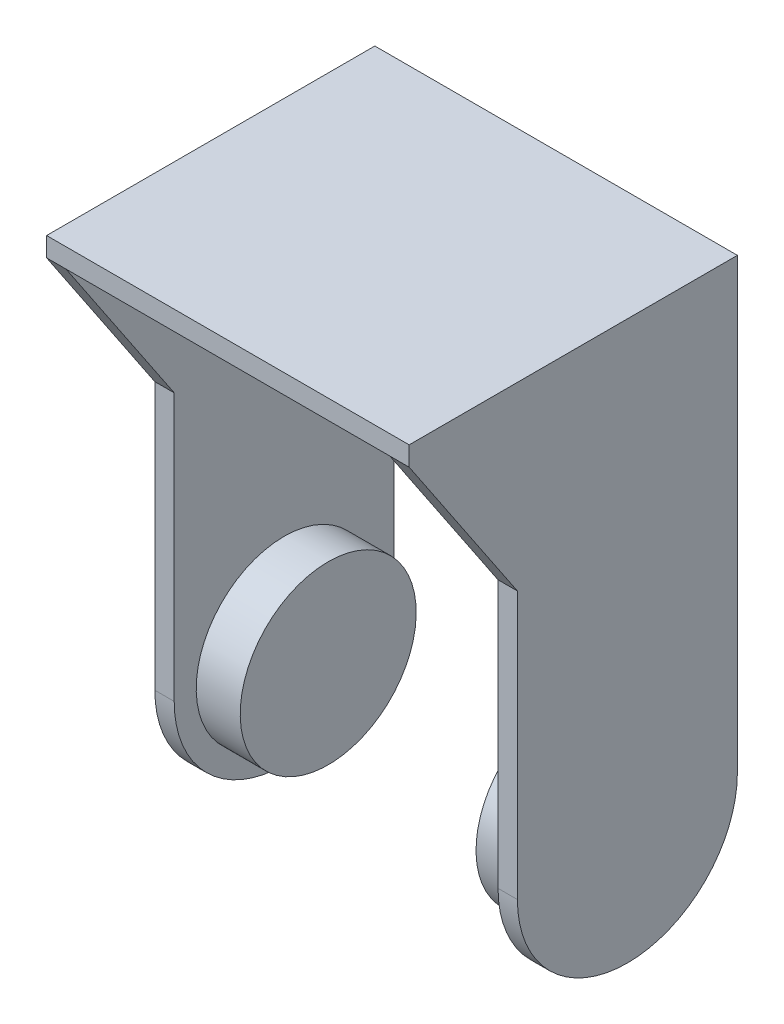
ISO-10303-21;
HEADER;
FILE_DESCRIPTION(('STEP AP214'),'2;1');
FILE_NAME('part.step','',(''),(''),'','','');
FILE_SCHEMA(('AUTOMOTIVE_DESIGN { 1 0 10303 214 1 1 1 1 }'));
ENDSEC;
DATA;
#1=APPLICATION_CONTEXT('core data for automotive mechanical design processes');
#2=APPLICATION_PROTOCOL_DEFINITION('international standard','automotive_design',2000,#1);
#3=PRODUCT_CONTEXT('',#1,'mechanical');
#4=PRODUCT('Part','Part','',(#3));
#5=PRODUCT_RELATED_PRODUCT_CATEGORY('part','',(#4));
#6=PRODUCT_DEFINITION_FORMATION('','',#4);
#7=PRODUCT_DEFINITION_CONTEXT('part definition',#1,'design');
#8=PRODUCT_DEFINITION('design','',#6,#7);
#9=PRODUCT_DEFINITION_SHAPE('','',#8);
#10=(LENGTH_UNIT() NAMED_UNIT(*) SI_UNIT(.MILLI.,.METRE.));
#11=(NAMED_UNIT(*) PLANE_ANGLE_UNIT() SI_UNIT($,.RADIAN.));
#12=(NAMED_UNIT(*) SI_UNIT($,.STERADIAN.) SOLID_ANGLE_UNIT());
#13=UNCERTAINTY_MEASURE_WITH_UNIT(LENGTH_MEASURE(1.E-05),#10,'distance_accuracy_value','');
#14=(GEOMETRIC_REPRESENTATION_CONTEXT(3) GLOBAL_UNCERTAINTY_ASSIGNED_CONTEXT((#13)) GLOBAL_UNIT_ASSIGNED_CONTEXT((#10,
#11,#12)) REPRESENTATION_CONTEXT('',''));
#15=CARTESIAN_POINT('',(0.,0.,0.));
#16=DIRECTION('',(0.,0.,1.));
#17=DIRECTION('',(1.,0.,0.));
#18=AXIS2_PLACEMENT_3D('',#15,#16,#17);
#19=CARTESIAN_POINT('',(41.2,42.8671094972797,25.));
#20=DIRECTION('',(0.,-0.557146091245593,0.830414494701144));
#21=DIRECTION('',(0.,-0.830414494701144,-0.557146091245593));
#22=AXIS2_PLACEMENT_3D('',#19,#20,#21);
#23=PLANE('',#22);
#24=DIRECTION('',(-1.,0.,0.));
#25=VECTOR('',#24,1.);
#26=CARTESIAN_POINT('',(41.2,42.8671094972797,25.));
#27=LINE('',#26,#25);
#28=CARTESIAN_POINT('',(2.2,42.8671094972797,25.));
#29=VERTEX_POINT('',#28);
#30=CARTESIAN_POINT('',(0.,42.8671094972797,25.));
#31=VERTEX_POINT('',#30);
#32=EDGE_CURVE('E247',#29,#31,#27,.T.);
#33=ORIENTED_EDGE('',*,*,#32,.F.);
#34=DIRECTION('',(0.,0.830414494701144,0.557146091245593));
#35=VECTOR('',#34,1.);
#36=CARTESIAN_POINT('',(2.2,42.8671094972797,25.));
#37=LINE('',#36,#35);
#38=CARTESIAN_POINT('',(2.2,61.2000000000008,37.3000000000024));
#39=VERTEX_POINT('',#38);
#40=EDGE_CURVE('E193',#29,#39,#37,.T.);
#41=ORIENTED_EDGE('',*,*,#40,.T.);
#42=DIRECTION('',(-1.,0.,0.));
#43=VECTOR('',#42,1.);
#44=CARTESIAN_POINT('',(41.2,61.2,37.3));
#45=LINE('',#44,#43);
#46=CARTESIAN_POINT('',(0.,61.2,37.3));
#47=VERTEX_POINT('',#46);
#48=EDGE_CURVE('E242',#39,#47,#45,.T.);
#49=ORIENTED_EDGE('',*,*,#48,.T.);
#50=DIRECTION('',(0.,0.830414494701144,0.557146091245593));
#51=VECTOR('',#50,1.);
#52=CARTESIAN_POINT('',(0.,42.8671094972797,25.));
#53=LINE('',#52,#51);
#54=EDGE_CURVE('E204',#31,#47,#53,.T.);
#55=ORIENTED_EDGE('',*,*,#54,.F.);
#56=EDGE_LOOP('',(#33,#41,#49,#55));
#57=FACE_BOUND('',#56,.T.);
#58=ADVANCED_FACE('F44',(#57),#23,.T.);
#59=CARTESIAN_POINT('',(41.2,61.2,37.3));
#60=VERTEX_POINT('',#59);
#61=CARTESIAN_POINT('',(39.,61.2000000000008,37.3000000000024));
#62=VERTEX_POINT('',#61);
#63=EDGE_CURVE('E237',#60,#62,#45,.T.);
#64=ORIENTED_EDGE('',*,*,#63,.T.);
#65=DIRECTION('',(0.,-0.830414494701144,-0.557146091245593));
#66=VECTOR('',#65,1.);
#67=CARTESIAN_POINT('',(39.,42.8671094972797,25.));
#68=LINE('',#67,#66);
#69=CARTESIAN_POINT('',(39.,42.8671094972797,25.));
#70=VERTEX_POINT('',#69);
#71=EDGE_CURVE('E186',#62,#70,#68,.T.);
#72=ORIENTED_EDGE('',*,*,#71,.T.);
#73=CARTESIAN_POINT('',(41.2,42.8671094972797,25.));
#74=VERTEX_POINT('',#73);
#75=EDGE_CURVE('E243',#74,#70,#27,.T.);
#76=ORIENTED_EDGE('',*,*,#75,.F.);
#77=DIRECTION('',(0.,0.830414494701144,0.557146091245593));
#78=VECTOR('',#77,1.);
#79=CARTESIAN_POINT('',(41.2,42.8671094972797,25.));
#80=LINE('',#79,#78);
#81=EDGE_CURVE('E215',#74,#60,#80,.T.);
#82=ORIENTED_EDGE('',*,*,#81,.T.);
#83=EDGE_LOOP('',(#64,#72,#76,#82));
#84=FACE_BOUND('',#83,.T.);
#85=ADVANCED_FACE('F310',(#84),#23,.T.);
#86=CARTESIAN_POINT('',(41.2,0.,25.));
#87=DIRECTION('',(0.,0.,1.));
#88=DIRECTION('',(1.,0.,0.));
#89=AXIS2_PLACEMENT_3D('',#86,#87,#88);
#90=PLANE('',#89);
#91=DIRECTION('',(0.,1.,0.));
#92=VECTOR('',#91,1.);
#93=CARTESIAN_POINT('',(0.,0.,25.));
#94=LINE('',#93,#92);
#95=CARTESIAN_POINT('',(0.,12.5,25.));
#96=VERTEX_POINT('',#95);
#97=EDGE_CURVE('E231',#96,#31,#94,.T.);
#98=ORIENTED_EDGE('',*,*,#97,.F.);
#99=DIRECTION('',(-1.,0.,0.));
#100=VECTOR('',#99,1.);
#101=CARTESIAN_POINT('',(41.2,12.5,25.));
#102=LINE('',#101,#100);
#103=CARTESIAN_POINT('',(2.20000000000001,12.5,25.));
#104=VERTEX_POINT('',#103);
#105=EDGE_CURVE('E262',#96,#104,#102,.F.);
#106=ORIENTED_EDGE('',*,*,#105,.T.);
#107=DIRECTION('',(0.,1.,0.));
#108=VECTOR('',#107,1.);
#109=CARTESIAN_POINT('',(2.20000000000001,0.,25.));
#110=LINE('',#109,#108);
#111=EDGE_CURVE('E190',#104,#29,#110,.T.);
#112=ORIENTED_EDGE('',*,*,#111,.T.);
#113=ORIENTED_EDGE('',*,*,#32,.T.);
#114=EDGE_LOOP('',(#98,#106,#112,#113));
#115=FACE_BOUND('',#114,.T.);
#116=ADVANCED_FACE('F328',(#115),#90,.T.);
#117=DIRECTION('',(0.,-1.,0.));
#118=VECTOR('',#117,1.);
#119=CARTESIAN_POINT('',(39.,0.,25.));
#120=LINE('',#119,#118);
#121=CARTESIAN_POINT('',(39.,12.5,25.));
#122=VERTEX_POINT('',#121);
#123=EDGE_CURVE('E154',#70,#122,#120,.T.);
#124=ORIENTED_EDGE('',*,*,#123,.T.);
#125=DIRECTION('',(-1.,0.,0.));
#126=VECTOR('',#125,1.);
#127=CARTESIAN_POINT('',(41.2,12.5,25.));
#128=LINE('',#127,#126);
#129=CARTESIAN_POINT('',(41.2,12.5,25.));
#130=VERTEX_POINT('',#129);
#131=EDGE_CURVE('E11',#122,#130,#128,.F.);
#132=ORIENTED_EDGE('',*,*,#131,.T.);
#133=DIRECTION('',(0.,1.,0.));
#134=VECTOR('',#133,1.);
#135=CARTESIAN_POINT('',(41.2,0.,25.));
#136=LINE('',#135,#134);
#137=EDGE_CURVE('E212',#130,#74,#136,.T.);
#138=ORIENTED_EDGE('',*,*,#137,.T.);
#139=ORIENTED_EDGE('',*,*,#75,.T.);
#140=EDGE_LOOP('',(#124,#132,#138,#139));
#141=FACE_BOUND('',#140,.T.);
#142=ADVANCED_FACE('F306',(#141),#90,.T.);
#143=CARTESIAN_POINT('',(41.2,63.4,0.));
#144=DIRECTION('',(0.,0.,-1.));
#145=DIRECTION('',(-1.,0.,0.));
#146=AXIS2_PLACEMENT_3D('',#143,#144,#145);
#147=PLANE('',#146);
#148=DIRECTION('',(0.,-1.,0.));
#149=VECTOR('',#148,1.);
#150=CARTESIAN_POINT('',(2.2,61.2,0.));
#151=LINE('',#150,#149);
#152=CARTESIAN_POINT('',(2.2,61.2,0.));
#153=VERTEX_POINT('',#152);
#154=CARTESIAN_POINT('',(2.20000000000001,12.5,0.));
#155=VERTEX_POINT('',#154);
#156=EDGE_CURVE('E158',#153,#155,#151,.T.);
#157=ORIENTED_EDGE('',*,*,#156,.T.);
#158=DIRECTION('',(-1.,0.,0.));
#159=VECTOR('',#158,1.);
#160=CARTESIAN_POINT('',(41.2,12.5,0.));
#161=LINE('',#160,#159);
#162=CARTESIAN_POINT('',(0.,12.5,0.));
#163=VERTEX_POINT('',#162);
#164=EDGE_CURVE('E274',#155,#163,#161,.T.);
#165=ORIENTED_EDGE('',*,*,#164,.T.);
#166=DIRECTION('',(0.,-1.,0.));
#167=VECTOR('',#166,1.);
#168=CARTESIAN_POINT('',(0.,63.4,0.));
#169=LINE('',#168,#167);
#170=CARTESIAN_POINT('',(0.,63.4,0.));
#171=VERTEX_POINT('',#170);
#172=EDGE_CURVE('E227',#171,#163,#169,.T.);
#173=ORIENTED_EDGE('',*,*,#172,.F.);
#174=DIRECTION('',(-1.,0.,0.));
#175=VECTOR('',#174,1.);
#176=CARTESIAN_POINT('',(41.2,63.4,0.));
#177=LINE('',#176,#175);
#178=CARTESIAN_POINT('',(41.2,63.4,0.));
#179=VERTEX_POINT('',#178);
#180=EDGE_CURVE('E248',#179,#171,#177,.T.);
#181=ORIENTED_EDGE('',*,*,#180,.F.);
#182=DIRECTION('',(0.,-1.,0.));
#183=VECTOR('',#182,1.);
#184=CARTESIAN_POINT('',(41.2,63.4,0.));
#185=LINE('',#184,#183);
#186=CARTESIAN_POINT('',(41.2,12.5,0.));
#187=VERTEX_POINT('',#186);
#188=EDGE_CURVE('E208',#179,#187,#185,.T.);
#189=ORIENTED_EDGE('',*,*,#188,.T.);
#190=DIRECTION('',(-1.,0.,0.));
#191=VECTOR('',#190,1.);
#192=CARTESIAN_POINT('',(41.2,12.5,0.));
#193=LINE('',#192,#191);
#194=CARTESIAN_POINT('',(39.,12.5,0.));
#195=VERTEX_POINT('',#194);
#196=EDGE_CURVE('E271',#187,#195,#193,.T.);
#197=ORIENTED_EDGE('',*,*,#196,.T.);
#198=DIRECTION('',(0.,1.,0.));
#199=VECTOR('',#198,1.);
#200=CARTESIAN_POINT('',(39.,0.,0.));
#201=LINE('',#200,#199);
#202=CARTESIAN_POINT('',(39.,61.2,0.));
#203=VERTEX_POINT('',#202);
#204=EDGE_CURVE('E166',#195,#203,#201,.T.);
#205=ORIENTED_EDGE('',*,*,#204,.T.);
#206=DIRECTION('',(-1.,0.,0.));
#207=VECTOR('',#206,1.);
#208=CARTESIAN_POINT('',(39.,61.2,0.));
#209=LINE('',#208,#207);
#210=EDGE_CURVE('E146',#203,#153,#209,.T.);
#211=ORIENTED_EDGE('',*,*,#210,.T.);
#212=EDGE_LOOP('',(#157,#165,#173,#181,#189,#197,#205,#211));
#213=FACE_BOUND('',#212,.T.);
#214=ADVANCED_FACE('F168',(#213),#147,.T.);
#215=CARTESIAN_POINT('',(41.2,61.2,37.3));
#216=DIRECTION('',(0.,0.,1.));
#217=DIRECTION('',(1.,0.,0.));
#218=AXIS2_PLACEMENT_3D('',#215,#216,#217);
#219=PLANE('',#218);
#220=DIRECTION('',(0.,1.,0.));
#221=VECTOR('',#220,1.);
#222=CARTESIAN_POINT('',(0.,61.2,37.3));
#223=LINE('',#222,#221);
#224=CARTESIAN_POINT('',(0.,63.4,37.3));
#225=VERTEX_POINT('',#224);
#226=EDGE_CURVE('E198',#47,#225,#223,.T.);
#227=ORIENTED_EDGE('',*,*,#226,.F.);
#228=ORIENTED_EDGE('',*,*,#48,.F.);
#229=DIRECTION('',(1.,0.,0.));
#230=VECTOR('',#229,1.);
#231=CARTESIAN_POINT('',(41.2,61.2,37.3));
#232=LINE('',#231,#230);
#233=EDGE_CURVE('E149',#39,#62,#232,.T.);
#234=ORIENTED_EDGE('',*,*,#233,.T.);
#235=ORIENTED_EDGE('',*,*,#63,.F.);
#236=DIRECTION('',(0.,1.,0.));
#237=VECTOR('',#236,1.);
#238=CARTESIAN_POINT('',(41.2,61.2,37.3));
#239=LINE('',#238,#237);
#240=CARTESIAN_POINT('',(41.2,63.4,37.3));
#241=VERTEX_POINT('',#240);
#242=EDGE_CURVE('E199',#60,#241,#239,.T.);
#243=ORIENTED_EDGE('',*,*,#242,.T.);
#244=DIRECTION('',(-1.,0.,0.));
#245=VECTOR('',#244,1.);
#246=CARTESIAN_POINT('',(41.2,63.4,37.3));
#247=LINE('',#246,#245);
#248=EDGE_CURVE('E219',#241,#225,#247,.T.);
#249=ORIENTED_EDGE('',*,*,#248,.T.);
#250=EDGE_LOOP('',(#227,#228,#234,#235,#243,#249));
#251=FACE_BOUND('',#250,.T.);
#252=ADVANCED_FACE('F317',(#251),#219,.T.);
#253=CARTESIAN_POINT('',(41.2,63.4,37.3));
#254=DIRECTION('',(0.,1.,0.));
#255=DIRECTION('',(0.,0.,1.));
#256=AXIS2_PLACEMENT_3D('',#253,#254,#255);
#257=PLANE('',#256);
#258=DIRECTION('',(0.,0.,-1.));
#259=VECTOR('',#258,1.);
#260=CARTESIAN_POINT('',(0.,63.4,37.3));
#261=LINE('',#260,#259);
#262=EDGE_CURVE('E223',#225,#171,#261,.T.);
#263=ORIENTED_EDGE('',*,*,#262,.F.);
#264=ORIENTED_EDGE('',*,*,#248,.F.);
#265=DIRECTION('',(0.,0.,-1.));
#266=VECTOR('',#265,1.);
#267=CARTESIAN_POINT('',(41.2,63.4,37.3));
#268=LINE('',#267,#266);
#269=EDGE_CURVE('E203',#241,#179,#268,.T.);
#270=ORIENTED_EDGE('',*,*,#269,.T.);
#271=ORIENTED_EDGE('',*,*,#180,.T.);
#272=EDGE_LOOP('',(#263,#264,#270,#271));
#273=FACE_BOUND('',#272,.T.);
#274=ADVANCED_FACE('F338',(#273),#257,.T.);
#275=CARTESIAN_POINT('',(41.2,0.,0.));
#276=DIRECTION('',(-1.,0.,0.));
#277=DIRECTION('',(0.,0.,1.));
#278=AXIS2_PLACEMENT_3D('',#275,#276,#277);
#279=PLANE('',#278);
#280=CARTESIAN_POINT('',(41.2,12.5,12.5));
#281=DIRECTION('',(-1.,0.,0.));
#282=DIRECTION('',(0.,0.,1.));
#283=AXIS2_PLACEMENT_3D('',#280,#281,#282);
#284=CIRCLE('',#283,12.5);
#285=CARTESIAN_POINT('',(41.2,0.,12.5));
#286=VERTEX_POINT('',#285);
#287=EDGE_CURVE('E62',#130,#286,#284,.F.);
#288=ORIENTED_EDGE('',*,*,#287,.T.);
#289=CARTESIAN_POINT('',(41.2,12.5,12.5));
#290=DIRECTION('',(-1.,0.,0.));
#291=DIRECTION('',(0.,0.,1.));
#292=AXIS2_PLACEMENT_3D('',#289,#290,#291);
#293=CIRCLE('',#292,12.5);
#294=EDGE_CURVE('E54',#286,#187,#293,.F.);
#295=ORIENTED_EDGE('',*,*,#294,.T.);
#296=ORIENTED_EDGE('',*,*,#188,.F.);
#297=ORIENTED_EDGE('',*,*,#269,.F.);
#298=ORIENTED_EDGE('',*,*,#242,.F.);
#299=ORIENTED_EDGE('',*,*,#81,.F.);
#300=ORIENTED_EDGE('',*,*,#137,.F.);
#301=EDGE_LOOP('',(#288,#295,#296,#297,#298,#299,#300));
#302=FACE_BOUND('',#301,.T.);
#303=ADVANCED_FACE('F312',(#302),#279,.F.);
#304=CARTESIAN_POINT('',(0.,0.,0.));
#305=DIRECTION('',(-1.,0.,0.));
#306=DIRECTION('',(0.,0.,1.));
#307=AXIS2_PLACEMENT_3D('',#304,#305,#306);
#308=PLANE('',#307);
#309=CARTESIAN_POINT('',(0.,12.5,12.5));
#310=DIRECTION('',(-1.,0.,0.));
#311=DIRECTION('',(0.,0.,1.));
#312=AXIS2_PLACEMENT_3D('',#309,#310,#311);
#313=CIRCLE('',#312,12.5);
#314=CARTESIAN_POINT('',(0.,0.,12.5));
#315=VERTEX_POINT('',#314);
#316=EDGE_CURVE('E256',#163,#315,#313,.T.);
#317=ORIENTED_EDGE('',*,*,#316,.T.);
#318=CARTESIAN_POINT('',(0.,12.5,12.5));
#319=DIRECTION('',(-1.,0.,0.));
#320=DIRECTION('',(0.,0.,1.));
#321=AXIS2_PLACEMENT_3D('',#318,#319,#320);
#322=CIRCLE('',#321,12.5);
#323=EDGE_CURVE('E259',#315,#96,#322,.T.);
#324=ORIENTED_EDGE('',*,*,#323,.T.);
#325=ORIENTED_EDGE('',*,*,#97,.T.);
#326=ORIENTED_EDGE('',*,*,#54,.T.);
#327=ORIENTED_EDGE('',*,*,#226,.T.);
#328=ORIENTED_EDGE('',*,*,#262,.T.);
#329=ORIENTED_EDGE('',*,*,#172,.T.);
#330=EDGE_LOOP('',(#317,#324,#325,#326,#327,#328,#329));
#331=FACE_BOUND('',#330,.T.);
#332=ADVANCED_FACE('F331',(#331),#308,.T.);
#333=CARTESIAN_POINT('',(39.,61.2,10000.));
#334=DIRECTION('',(0.,-1.,0.));
#335=DIRECTION('',(1.,0.,0.));
#336=AXIS2_PLACEMENT_3D('',#333,#334,#335);
#337=PLANE('',#336);
#338=DIRECTION('',(0.,0.,-1.));
#339=VECTOR('',#338,1.);
#340=CARTESIAN_POINT('',(2.2,61.2,10000.));
#341=LINE('',#340,#339);
#342=EDGE_CURVE('E141',#39,#153,#341,.T.);
#343=ORIENTED_EDGE('',*,*,#342,.T.);
#344=ORIENTED_EDGE('',*,*,#210,.F.);
#345=DIRECTION('',(0.,0.,-1.));
#346=VECTOR('',#345,1.);
#347=CARTESIAN_POINT('',(39.,61.2,10000.));
#348=LINE('',#347,#346);
#349=EDGE_CURVE('E155',#62,#203,#348,.T.);
#350=ORIENTED_EDGE('',*,*,#349,.F.);
#351=ORIENTED_EDGE('',*,*,#233,.F.);
#352=EDGE_LOOP('',(#343,#344,#350,#351));
#353=FACE_BOUND('',#352,.T.);
#354=ADVANCED_FACE('F143',(#353),#337,.T.);
#355=CARTESIAN_POINT('',(2.2,61.2,10000.));
#356=DIRECTION('',(1.,0.,0.));
#357=DIRECTION('',(0.,1.,0.));
#358=AXIS2_PLACEMENT_3D('',#355,#356,#357);
#359=PLANE('',#358);
#360=CARTESIAN_POINT('',(2.20000000000001,12.5000000000002,12.5000000000002));
#361=DIRECTION('',(1.,0.,0.));
#362=DIRECTION('',(0.,1.,0.));
#363=AXIS2_PLACEMENT_3D('',#360,#361,#362);
#364=CIRCLE('',#363,10.);
#365=CARTESIAN_POINT('',(2.20000000000001,22.5000000000002,12.5000000000002));
#366=VERTEX_POINT('',#365);
#367=EDGE_CURVE('E176',#366,#366,#364,.T.);
#368=ORIENTED_EDGE('',*,*,#367,.F.);
#369=EDGE_LOOP('',(#368));
#370=FACE_BOUND('',#369,.T.);
#371=ORIENTED_EDGE('',*,*,#111,.F.);
#372=CARTESIAN_POINT('',(2.20000000000001,12.5,12.5));
#373=DIRECTION('',(1.,0.,0.));
#374=DIRECTION('',(0.,1.,0.));
#375=AXIS2_PLACEMENT_3D('',#372,#373,#374);
#376=CIRCLE('',#375,12.5);
#377=CARTESIAN_POINT('',(2.20000000000001,0.,12.4999999999993));
#378=VERTEX_POINT('',#377);
#379=EDGE_CURVE('E268',#104,#378,#376,.T.);
#380=ORIENTED_EDGE('',*,*,#379,.T.);
#381=CARTESIAN_POINT('',(2.20000000000001,12.5,12.5));
#382=DIRECTION('',(1.,0.,0.));
#383=DIRECTION('',(0.,1.,0.));
#384=AXIS2_PLACEMENT_3D('',#381,#382,#383);
#385=CIRCLE('',#384,12.5);
#386=EDGE_CURVE('E162',#378,#155,#385,.T.);
#387=ORIENTED_EDGE('',*,*,#386,.T.);
#388=ORIENTED_EDGE('',*,*,#156,.F.);
#389=ORIENTED_EDGE('',*,*,#342,.F.);
#390=ORIENTED_EDGE('',*,*,#40,.F.);
#391=EDGE_LOOP('',(#371,#380,#387,#388,#389,#390));
#392=FACE_BOUND('',#391,.T.);
#393=ADVANCED_FACE('F160',(#370,#392),#359,.T.);
#394=CARTESIAN_POINT('',(39.,0.,10000.));
#395=DIRECTION('',(-1.,0.,0.));
#396=DIRECTION('',(0.,0.,1.));
#397=AXIS2_PLACEMENT_3D('',#394,#395,#396);
#398=PLANE('',#397);
#399=CARTESIAN_POINT('',(39.,12.5000000000002,12.5000000000002));
#400=DIRECTION('',(-1.,0.,0.));
#401=DIRECTION('',(0.,0.,1.));
#402=AXIS2_PLACEMENT_3D('',#399,#400,#401);
#403=CIRCLE('',#402,10.);
#404=CARTESIAN_POINT('',(39.,12.5000000000002,22.5000000000002));
#405=VERTEX_POINT('',#404);
#406=EDGE_CURVE('E241',#405,#405,#403,.T.);
#407=ORIENTED_EDGE('',*,*,#406,.F.);
#408=EDGE_LOOP('',(#407));
#409=FACE_BOUND('',#408,.T.);
#410=ORIENTED_EDGE('',*,*,#204,.F.);
#411=CARTESIAN_POINT('',(39.,12.5,12.5));
#412=DIRECTION('',(-1.,0.,0.));
#413=DIRECTION('',(0.,0.,1.));
#414=AXIS2_PLACEMENT_3D('',#411,#412,#413);
#415=CIRCLE('',#414,12.5);
#416=CARTESIAN_POINT('',(39.,0.,12.4999999999993));
#417=VERTEX_POINT('',#416);
#418=EDGE_CURVE('E280',#195,#417,#415,.T.);
#419=ORIENTED_EDGE('',*,*,#418,.T.);
#420=CARTESIAN_POINT('',(39.,12.5,12.5));
#421=DIRECTION('',(-1.,0.,0.));
#422=DIRECTION('',(0.,0.,1.));
#423=AXIS2_PLACEMENT_3D('',#420,#421,#422);
#424=CIRCLE('',#423,12.5);
#425=EDGE_CURVE('E277',#417,#122,#424,.T.);
#426=ORIENTED_EDGE('',*,*,#425,.T.);
#427=ORIENTED_EDGE('',*,*,#123,.F.);
#428=ORIENTED_EDGE('',*,*,#71,.F.);
#429=ORIENTED_EDGE('',*,*,#349,.T.);
#430=EDGE_LOOP('',(#410,#419,#426,#427,#428,#429));
#431=FACE_BOUND('',#430,.T.);
#432=ADVANCED_FACE('F305',(#409,#431),#398,.T.);
#433=CARTESIAN_POINT('',(7.20000000000001,12.5000000000002,12.5000000000002));
#434=DIRECTION('',(-1.,0.,0.));
#435=DIRECTION('',(0.,-1.,0.));
#436=AXIS2_PLACEMENT_3D('',#433,#434,#435);
#437=CYLINDRICAL_SURFACE('',#436,10.);
#438=CARTESIAN_POINT('',(7.20000000000001,12.5000000000002,12.5000000000002));
#439=DIRECTION('',(1.,0.,0.));
#440=DIRECTION('',(0.,1.,0.));
#441=AXIS2_PLACEMENT_3D('',#438,#439,#440);
#442=CIRCLE('',#441,10.);
#443=CARTESIAN_POINT('',(7.20000000000001,22.5000000000002,12.5000000000002));
#444=VERTEX_POINT('',#443);
#445=EDGE_CURVE('E172',#444,#444,#442,.T.);
#446=ORIENTED_EDGE('',*,*,#445,.F.);
#447=EDGE_LOOP('',(#446));
#448=FACE_BOUND('',#447,.T.);
#449=ORIENTED_EDGE('',*,*,#367,.T.);
#450=EDGE_LOOP('',(#449));
#451=FACE_BOUND('',#450,.T.);
#452=ADVANCED_FACE('F399',(#448,#451),#437,.T.);
#453=CARTESIAN_POINT('',(7.20000000000001,12.5000000000002,12.5000000000002));
#454=DIRECTION('',(1.,0.,0.));
#455=DIRECTION('',(0.,1.,0.));
#456=AXIS2_PLACEMENT_3D('',#453,#454,#455);
#457=PLANE('',#456);
#458=ORIENTED_EDGE('',*,*,#445,.T.);
#459=EDGE_LOOP('',(#458));
#460=FACE_BOUND('',#459,.T.);
#461=ADVANCED_FACE('F388',(#460),#457,.T.);
#462=CARTESIAN_POINT('',(34.,12.5000000000002,12.5000000000002));
#463=DIRECTION('',(1.,0.,0.));
#464=DIRECTION('',(0.,0.,-1.));
#465=AXIS2_PLACEMENT_3D('',#462,#463,#464);
#466=CYLINDRICAL_SURFACE('',#465,10.);
#467=CARTESIAN_POINT('',(34.,12.5000000000002,12.5000000000002));
#468=DIRECTION('',(1.,0.,0.));
#469=DIRECTION('',(0.,1.,0.));
#470=AXIS2_PLACEMENT_3D('',#467,#468,#469);
#471=CIRCLE('',#470,10.);
#472=CARTESIAN_POINT('',(34.,22.5000000000002,12.5000000000002));
#473=VERTEX_POINT('',#472);
#474=EDGE_CURVE('E289',#473,#473,#471,.T.);
#475=ORIENTED_EDGE('',*,*,#474,.T.);
#476=EDGE_LOOP('',(#475));
#477=FACE_BOUND('',#476,.T.);
#478=ORIENTED_EDGE('',*,*,#406,.T.);
#479=EDGE_LOOP('',(#478));
#480=FACE_BOUND('',#479,.T.);
#481=ADVANCED_FACE('F375',(#477,#480),#466,.T.);
#482=CARTESIAN_POINT('',(34.,12.5000000000002,12.5000000000002));
#483=DIRECTION('',(-1.,0.,0.));
#484=DIRECTION('',(0.,1.,0.));
#485=AXIS2_PLACEMENT_3D('',#482,#483,#484);
#486=PLANE('',#485);
#487=ORIENTED_EDGE('',*,*,#474,.F.);
#488=EDGE_LOOP('',(#487));
#489=FACE_BOUND('',#488,.T.);
#490=ADVANCED_FACE('F370',(#489),#486,.T.);
#491=CARTESIAN_POINT('',(41.2,12.5,12.5));
#492=DIRECTION('',(-1.,0.,0.));
#493=DIRECTION('',(0.,0.,1.));
#494=AXIS2_PLACEMENT_3D('',#491,#492,#493);
#495=CYLINDRICAL_SURFACE('',#494,12.5);
#496=ORIENTED_EDGE('',*,*,#164,.F.);
#497=ORIENTED_EDGE('',*,*,#386,.F.);
#498=DIRECTION('',(-1.,0.,0.));
#499=VECTOR('',#498,1.);
#500=CARTESIAN_POINT('',(41.2,0.,12.5));
#501=LINE('',#500,#499);
#502=EDGE_CURVE('E286',#315,#378,#501,.F.);
#503=ORIENTED_EDGE('',*,*,#502,.F.);
#504=ORIENTED_EDGE('',*,*,#316,.F.);
#505=EDGE_LOOP('',(#496,#497,#503,#504));
#506=FACE_BOUND('',#505,.T.);
#507=ADVANCED_FACE('F335',(#506),#495,.T.);
#508=CARTESIAN_POINT('',(41.2,12.5,12.5));
#509=DIRECTION('',(-1.,0.,0.));
#510=DIRECTION('',(0.,0.,1.));
#511=AXIS2_PLACEMENT_3D('',#508,#509,#510);
#512=CYLINDRICAL_SURFACE('',#511,12.5);
#513=ORIENTED_EDGE('',*,*,#379,.F.);
#514=ORIENTED_EDGE('',*,*,#105,.F.);
#515=ORIENTED_EDGE('',*,*,#323,.F.);
#516=ORIENTED_EDGE('',*,*,#502,.T.);
#517=EDGE_LOOP('',(#513,#514,#515,#516));
#518=FACE_BOUND('',#517,.T.);
#519=ADVANCED_FACE('F333',(#518),#512,.T.);
#520=CARTESIAN_POINT('',(41.2,12.5,12.5));
#521=DIRECTION('',(-1.,0.,0.));
#522=DIRECTION('',(0.,0.,1.));
#523=AXIS2_PLACEMENT_3D('',#520,#521,#522);
#524=CYLINDRICAL_SURFACE('',#523,12.5);
#525=DIRECTION('',(-1.,0.,0.));
#526=VECTOR('',#525,1.);
#527=CARTESIAN_POINT('',(41.2,0.,12.5));
#528=LINE('',#527,#526);
#529=EDGE_CURVE('E48',#286,#417,#528,.T.);
#530=ORIENTED_EDGE('',*,*,#529,.F.);
#531=ORIENTED_EDGE('',*,*,#287,.F.);
#532=ORIENTED_EDGE('',*,*,#131,.F.);
#533=ORIENTED_EDGE('',*,*,#425,.F.);
#534=EDGE_LOOP('',(#530,#531,#532,#533));
#535=FACE_BOUND('',#534,.T.);
#536=ADVANCED_FACE('F46',(#535),#524,.T.);
#537=CARTESIAN_POINT('',(41.2,12.5,12.5));
#538=DIRECTION('',(-1.,0.,0.));
#539=DIRECTION('',(0.,0.,1.));
#540=AXIS2_PLACEMENT_3D('',#537,#538,#539);
#541=CYLINDRICAL_SURFACE('',#540,12.5);
#542=ORIENTED_EDGE('',*,*,#294,.F.);
#543=ORIENTED_EDGE('',*,*,#529,.T.);
#544=ORIENTED_EDGE('',*,*,#418,.F.);
#545=ORIENTED_EDGE('',*,*,#196,.F.);
#546=EDGE_LOOP('',(#542,#543,#544,#545));
#547=FACE_BOUND('',#546,.T.);
#548=ADVANCED_FACE('F300',(#547),#541,.T.);
#549=CLOSED_SHELL('',(#58,#85,#116,#142,#214,#252,#274,#303,#332,#354,#393,#432,#452,#461,#481,
#490,#507,#519,#536,#548));
#550=MANIFOLD_SOLID_BREP('B2',#549);
#551=ADVANCED_BREP_SHAPE_REPRESENTATION('',(#18,#550),#14);
#552=SHAPE_DEFINITION_REPRESENTATION(#9,#551);
ENDSEC;
END-ISO-10303-21;
